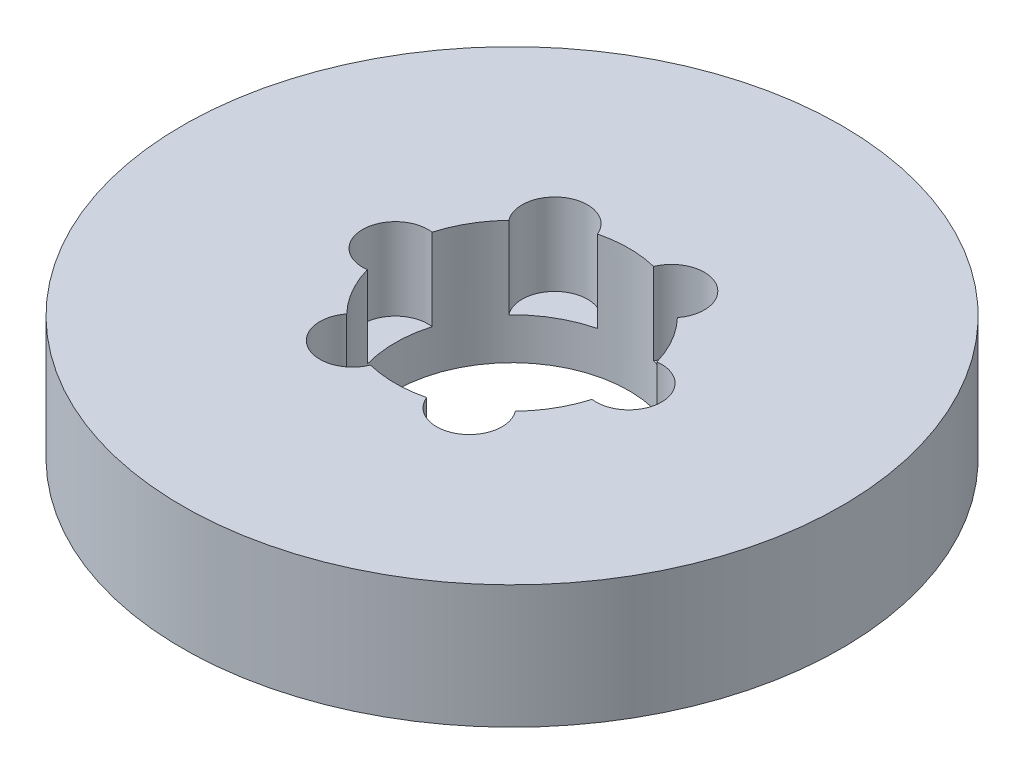
ISO-10303-21;
HEADER;
FILE_DESCRIPTION(('STEP AP214'),'2;1');
FILE_NAME('part.step','',(''),(''),'','','');
FILE_SCHEMA(('AUTOMOTIVE_DESIGN { 1 0 10303 214 1 1 1 1 }'));
ENDSEC;
DATA;
#1=APPLICATION_CONTEXT('core data for automotive mechanical design processes');
#2=APPLICATION_PROTOCOL_DEFINITION('international standard','automotive_design',2000,#1);
#3=PRODUCT_CONTEXT('',#1,'mechanical');
#4=PRODUCT('Part','Part','',(#3));
#5=PRODUCT_RELATED_PRODUCT_CATEGORY('part','',(#4));
#6=PRODUCT_DEFINITION_FORMATION('','',#4);
#7=PRODUCT_DEFINITION_CONTEXT('part definition',#1,'design');
#8=PRODUCT_DEFINITION('design','',#6,#7);
#9=PRODUCT_DEFINITION_SHAPE('','',#8);
#10=(LENGTH_UNIT() NAMED_UNIT(*) SI_UNIT(.MILLI.,.METRE.));
#11=(NAMED_UNIT(*) PLANE_ANGLE_UNIT() SI_UNIT($,.RADIAN.));
#12=(NAMED_UNIT(*) SI_UNIT($,.STERADIAN.) SOLID_ANGLE_UNIT());
#13=UNCERTAINTY_MEASURE_WITH_UNIT(LENGTH_MEASURE(1.E-05),#10,'distance_accuracy_value','');
#14=(GEOMETRIC_REPRESENTATION_CONTEXT(3) GLOBAL_UNCERTAINTY_ASSIGNED_CONTEXT((#13)) GLOBAL_UNIT_ASSIGNED_CONTEXT((#10,
#11,#12)) REPRESENTATION_CONTEXT('',''));
#15=CARTESIAN_POINT('',(0.,0.,0.));
#16=DIRECTION('',(0.,0.,1.));
#17=DIRECTION('',(1.,0.,0.));
#18=AXIS2_PLACEMENT_3D('',#15,#16,#17);
#19=CARTESIAN_POINT('',(0.,29.,0.));
#20=DIRECTION('',(0.,-1.,0.));
#21=DIRECTION('',(0.,0.,-1.));
#22=AXIS2_PLACEMENT_3D('',#19,#20,#21);
#23=CYLINDRICAL_SURFACE('',#22,77.5);
#24=CARTESIAN_POINT('',(0.,29.,0.));
#25=DIRECTION('',(0.,1.,0.));
#26=DIRECTION('',(0.,0.,1.));
#27=AXIS2_PLACEMENT_3D('',#24,#25,#26);
#28=CIRCLE('',#27,77.5);
#29=CARTESIAN_POINT('',(0.,29.,-77.5));
#30=VERTEX_POINT('',#29);
#31=EDGE_CURVE('E171',#30,#30,#28,.T.);
#32=CARTESIAN_POINT('',(0.,0.,0.));
#33=DIRECTION('',(0.,1.,0.));
#34=DIRECTION('',(0.,0.,1.));
#35=AXIS2_PLACEMENT_3D('',#32,#33,#34);
#36=CIRCLE('',#35,77.5);
#37=CARTESIAN_POINT('',(0.,0.,-77.5));
#38=VERTEX_POINT('',#37);
#39=EDGE_CURVE('E157',#38,#38,#36,.T.);
#40=CARTESIAN_POINT('',(0.,29.,-77.5));
#41=CARTESIAN_POINT('',(0.,28.6979166666667,-77.5));
#42=CARTESIAN_POINT('',(0.,28.3958333333333,-77.5));
#43=CARTESIAN_POINT('',(0.,27.7916666666667,-77.5));
#44=CARTESIAN_POINT('',(0.,27.4895833333333,-77.5));
#45=CARTESIAN_POINT('',(0.,26.8854166666667,-77.5));
#46=CARTESIAN_POINT('',(0.,26.5833333333333,-77.5));
#47=CARTESIAN_POINT('',(0.,25.9791666666667,-77.5));
#48=CARTESIAN_POINT('',(0.,25.6770833333333,-77.5));
#49=CARTESIAN_POINT('',(0.,25.0729166666667,-77.5));
#50=CARTESIAN_POINT('',(0.,24.7708333333333,-77.5));
#51=CARTESIAN_POINT('',(0.,24.1666666666667,-77.5));
#52=CARTESIAN_POINT('',(0.,23.8645833333333,-77.5));
#53=CARTESIAN_POINT('',(0.,23.2604166666667,-77.5));
#54=CARTESIAN_POINT('',(0.,22.9583333333333,-77.5));
#55=CARTESIAN_POINT('',(0.,22.3541666666667,-77.5));
#56=CARTESIAN_POINT('',(0.,22.0520833333333,-77.5));
#57=CARTESIAN_POINT('',(0.,21.4479166666667,-77.5));
#58=CARTESIAN_POINT('',(0.,21.1458333333333,-77.5));
#59=CARTESIAN_POINT('',(0.,20.5416666666667,-77.5));
#60=CARTESIAN_POINT('',(0.,20.2395833333333,-77.5));
#61=CARTESIAN_POINT('',(0.,19.6354166666667,-77.5));
#62=CARTESIAN_POINT('',(0.,19.3333333333333,-77.5));
#63=CARTESIAN_POINT('',(0.,18.7291666666667,-77.5));
#64=CARTESIAN_POINT('',(0.,18.4270833333333,-77.5));
#65=CARTESIAN_POINT('',(0.,17.8229166666667,-77.5));
#66=CARTESIAN_POINT('',(0.,17.5208333333333,-77.5));
#67=CARTESIAN_POINT('',(0.,16.9166666666667,-77.5));
#68=CARTESIAN_POINT('',(0.,16.6145833333333,-77.5));
#69=CARTESIAN_POINT('',(0.,16.0104166666667,-77.5));
#70=CARTESIAN_POINT('',(0.,15.7083333333333,-77.5));
#71=CARTESIAN_POINT('',(0.,15.1041666666667,-77.5));
#72=CARTESIAN_POINT('',(0.,14.8020833333333,-77.5));
#73=CARTESIAN_POINT('',(0.,14.1979166666667,-77.5));
#74=CARTESIAN_POINT('',(0.,13.8958333333333,-77.5));
#75=CARTESIAN_POINT('',(0.,13.2916666666667,-77.5));
#76=CARTESIAN_POINT('',(0.,12.9895833333333,-77.5));
#77=CARTESIAN_POINT('',(0.,12.3854166666667,-77.5));
#78=CARTESIAN_POINT('',(0.,12.0833333333333,-77.5));
#79=CARTESIAN_POINT('',(0.,11.4791666666667,-77.5));
#80=CARTESIAN_POINT('',(0.,11.1770833333333,-77.5));
#81=CARTESIAN_POINT('',(0.,10.5729166666667,-77.5));
#82=CARTESIAN_POINT('',(0.,10.2708333333333,-77.5));
#83=CARTESIAN_POINT('',(0.,9.66666666666667,-77.5));
#84=CARTESIAN_POINT('',(0.,9.36458333333333,-77.5));
#85=CARTESIAN_POINT('',(0.,8.76041666666667,-77.5));
#86=CARTESIAN_POINT('',(0.,8.45833333333333,-77.5));
#87=CARTESIAN_POINT('',(0.,7.85416666666667,-77.5));
#88=CARTESIAN_POINT('',(0.,7.55208333333333,-77.5));
#89=CARTESIAN_POINT('',(0.,6.94791666666667,-77.5));
#90=CARTESIAN_POINT('',(0.,6.64583333333333,-77.5));
#91=CARTESIAN_POINT('',(0.,6.04166666666667,-77.5));
#92=CARTESIAN_POINT('',(0.,5.73958333333333,-77.5));
#93=CARTESIAN_POINT('',(0.,5.13541666666667,-77.5));
#94=CARTESIAN_POINT('',(0.,4.83333333333333,-77.5));
#95=CARTESIAN_POINT('',(0.,4.22916666666667,-77.5));
#96=CARTESIAN_POINT('',(0.,3.92708333333333,-77.5));
#97=CARTESIAN_POINT('',(0.,3.32291666666667,-77.5));
#98=CARTESIAN_POINT('',(0.,3.02083333333333,-77.5));
#99=CARTESIAN_POINT('',(0.,2.41666666666667,-77.5));
#100=CARTESIAN_POINT('',(0.,2.11458333333333,-77.5));
#101=CARTESIAN_POINT('',(0.,1.51041666666667,-77.5));
#102=CARTESIAN_POINT('',(0.,1.20833333333333,-77.5));
#103=CARTESIAN_POINT('',(0.,0.604166666666667,-77.5));
#104=CARTESIAN_POINT('',(0.,0.302083333333333,-77.5));
#105=CARTESIAN_POINT('',(0.,0.,-77.5));
#106=B_SPLINE_CURVE_WITH_KNOTS('',3,(#40,#41,#42,#43,#44,#45,#46,#47,#48,#49,#50,#51,#52,#53,
#54,#55,#56,#57,#58,#59,#60,#61,#62,#63,#64,#65,#66,#67,#68,#69,#70,#71,#72,#73,#74,#75,#76,#77,
#78,#79,#80,#81,#82,#83,#84,#85,#86,#87,#88,#89,#90,#91,#92,#93,#94,#95,#96,#97,#98,#99,#100,
#101,#102,#103,#104,#105),.UNSPECIFIED.,.F.,.F.,(4,2,2,2,2,2,2,2,2,2,2,2,2,2,2,2,2,2,2,2,2,2,2,
2,2,2,2,2,2,2,2,2,4),(0.,0.906249999999997,1.8125,2.71875,3.625,4.53125,5.4375,6.34375,7.25,
8.15625,9.0625,9.96875,10.875,11.78125,12.6875,13.59375,14.5,15.40625,16.3125,17.21875,18.125,
19.03125,19.9375,20.84375,21.75,22.65625,23.5625,24.46875,25.375,26.28125,27.1875,28.09375,29.),.UNSPECIFIED.);
#107=EDGE_CURVE('BSEAM39',#30,#38,#106,.T.);
#108=ORIENTED_EDGE('',*,*,#31,.F.);
#109=ORIENTED_EDGE('',*,*,#39,.T.);
#110=ORIENTED_EDGE('',*,*,#107,.T.);
#111=ORIENTED_EDGE('',*,*,#107,.F.);
#112=EDGE_LOOP('',(#108,#110,#109,#111));
#113=FACE_BOUND('',#112,.T.);
#114=ADVANCED_FACE('F39',(#113),#23,.T.);
#115=CARTESIAN_POINT('',(0.,29.,0.));
#116=DIRECTION('',(0.,1.,0.));
#117=DIRECTION('',(0.,0.,1.));
#118=AXIS2_PLACEMENT_3D('',#115,#116,#117);
#119=PLANE('',#118);
#120=CARTESIAN_POINT('',(-13.7271433398994,29.,-23.7761097074858));
#121=DIRECTION('',(0.,1.,0.));
#122=DIRECTION('',(-0.866025403784433,0.,0.50000000000001));
#123=AXIS2_PLACEMENT_3D('',#120,#121,#122);
#124=CIRCLE('',#123,7.70044387345522);
#125=CARTESIAN_POINT('',(-6.60169345907737,29.,-26.695835695336));
#126=VERTEX_POINT('',#125);
#127=CARTESIAN_POINT('',(-19.8184251578781,29.,-19.0651520912261));
#128=VERTEX_POINT('',#127);
#129=EDGE_CURVE('E214',#126,#128,#124,.T.);
#130=ORIENTED_EDGE('',*,*,#129,.F.);
#131=CARTESIAN_POINT('',(0.,29.,0.));
#132=DIRECTION('',(0.,1.,0.));
#133=DIRECTION('',(0.,0.,1.));
#134=AXIS2_PLACEMENT_3D('',#131,#132,#133);
#135=CIRCLE('',#134,27.5);
#136=CARTESIAN_POINT('',(6.60169345907681,29.,-26.6958356953361));
#137=VERTEX_POINT('',#136);
#138=EDGE_CURVE('E272',#137,#126,#135,.T.);
#139=ORIENTED_EDGE('',*,*,#138,.F.);
#140=CARTESIAN_POINT('',(13.7271433398989,29.,-23.7761097074861));
#141=DIRECTION('',(0.,1.,0.));
#142=DIRECTION('',(-0.866025403784443,0.,-0.499999999999992));
#143=AXIS2_PLACEMENT_3D('',#140,#141,#142);
#144=CIRCLE('',#143,7.70044387345522);
#145=CARTESIAN_POINT('',(19.8184251578777,29.,-19.0651520912265));
#146=VERTEX_POINT('',#145);
#147=EDGE_CURVE('E285',#146,#137,#144,.T.);
#148=ORIENTED_EDGE('',*,*,#147,.F.);
#149=CARTESIAN_POINT('',(26.420118616955,29.,-7.63068360410973));
#150=VERTEX_POINT('',#149);
#151=EDGE_CURVE('E165',#150,#146,#135,.T.);
#152=ORIENTED_EDGE('',*,*,#151,.F.);
#153=CARTESIAN_POINT('',(27.4542866797982,29.,0.));
#154=DIRECTION('',(0.,1.,0.));
#155=DIRECTION('',(0.,0.,-1.));
#156=AXIS2_PLACEMENT_3D('',#153,#154,#155);
#157=CIRCLE('',#156,7.70044387345522);
#158=CARTESIAN_POINT('',(26.420118616955,29.,7.63068360410973));
#159=VERTEX_POINT('',#158);
#160=EDGE_CURVE('E281',#159,#150,#157,.T.);
#161=ORIENTED_EDGE('',*,*,#160,.F.);
#162=CARTESIAN_POINT('',(19.818425157878,29.,19.0651520912262));
#163=VERTEX_POINT('',#162);
#164=EDGE_CURVE('E160',#163,#159,#135,.T.);
#165=ORIENTED_EDGE('',*,*,#164,.F.);
#166=CARTESIAN_POINT('',(13.7271433398992,29.,23.7761097074859));
#167=DIRECTION('',(0.,1.,0.));
#168=DIRECTION('',(0.866025403784436,0.,-0.500000000000004));
#169=AXIS2_PLACEMENT_3D('',#166,#167,#168);
#170=CIRCLE('',#169,7.70044387345522);
#171=CARTESIAN_POINT('',(6.60169345907719,29.,26.695835695336));
#172=VERTEX_POINT('',#171);
#173=EDGE_CURVE('E154',#172,#163,#170,.T.);
#174=ORIENTED_EDGE('',*,*,#173,.F.);
#175=CARTESIAN_POINT('',(-6.601693459077,29.,26.6958356953361));
#176=VERTEX_POINT('',#175);
#177=EDGE_CURVE('E150',#176,#172,#135,.T.);
#178=ORIENTED_EDGE('',*,*,#177,.F.);
#179=CARTESIAN_POINT('',(-13.727143339899,29.,23.776109707486));
#180=DIRECTION('',(0.,1.,0.));
#181=DIRECTION('',(0.86602540378444,0.,0.499999999999998));
#182=AXIS2_PLACEMENT_3D('',#179,#180,#181);
#183=CIRCLE('',#182,7.70044387345522);
#184=CARTESIAN_POINT('',(-19.8184251578779,29.,19.0651520912264));
#185=VERTEX_POINT('',#184);
#186=EDGE_CURVE('E127',#185,#176,#183,.T.);
#187=ORIENTED_EDGE('',*,*,#186,.F.);
#188=CARTESIAN_POINT('',(-26.420118616955,29.,7.63068360410973));
#189=VERTEX_POINT('',#188);
#190=EDGE_CURVE('E156',#189,#185,#135,.T.);
#191=ORIENTED_EDGE('',*,*,#190,.F.);
#192=CARTESIAN_POINT('',(-27.4542866797982,29.,0.));
#193=DIRECTION('',(0.,1.,0.));
#194=DIRECTION('',(0.,0.,1.));
#195=AXIS2_PLACEMENT_3D('',#192,#193,#194);
#196=CIRCLE('',#195,7.70044387345522);
#197=CARTESIAN_POINT('',(-26.420118616955,29.,-7.63068360410973));
#198=VERTEX_POINT('',#197);
#199=EDGE_CURVE('E164',#198,#189,#196,.T.);
#200=ORIENTED_EDGE('',*,*,#199,.F.);
#201=EDGE_CURVE('E159',#128,#198,#135,.T.);
#202=ORIENTED_EDGE('',*,*,#201,.F.);
#203=EDGE_LOOP('',(#130,#139,#148,#152,#161,#165,#174,#178,#187,#191,#200,#202));
#204=FACE_BOUND('',#203,.T.);
#205=ORIENTED_EDGE('',*,*,#31,.T.);
#206=EDGE_LOOP('',(#205));
#207=FACE_BOUND('',#206,.T.);
#208=ADVANCED_FACE('F155',(#204,#207),#119,.T.);
#209=CARTESIAN_POINT('',(0.,0.,0.));
#210=DIRECTION('',(0.,1.,0.));
#211=DIRECTION('',(0.,0.,1.));
#212=AXIS2_PLACEMENT_3D('',#209,#210,#211);
#213=PLANE('',#212);
#214=CARTESIAN_POINT('',(0.,0.,0.));
#215=DIRECTION('',(0.,1.,0.));
#216=DIRECTION('',(0.,0.,1.));
#217=AXIS2_PLACEMENT_3D('',#214,#215,#216);
#218=CIRCLE('',#217,27.5);
#219=CARTESIAN_POINT('',(0.,0.,27.5));
#220=VERTEX_POINT('',#219);
#221=EDGE_CURVE('E170',#220,#220,#218,.T.);
#222=ORIENTED_EDGE('',*,*,#221,.T.);
#223=EDGE_LOOP('',(#222));
#224=FACE_BOUND('',#223,.T.);
#225=ORIENTED_EDGE('',*,*,#39,.F.);
#226=EDGE_LOOP('',(#225));
#227=FACE_BOUND('',#226,.T.);
#228=ADVANCED_FACE('F232',(#224,#227),#213,.F.);
#229=CARTESIAN_POINT('',(0.,29.,0.));
#230=DIRECTION('',(0.,-1.,0.));
#231=DIRECTION('',(0.,0.,-1.));
#232=AXIS2_PLACEMENT_3D('',#229,#230,#231);
#233=CYLINDRICAL_SURFACE('',#232,27.5);
#234=DIRECTION('',(0.,1.,0.));
#235=VECTOR('',#234,1.);
#236=CARTESIAN_POINT('',(-6.60169345907737,19.3809823346453,-26.695835695336));
#237=LINE('',#236,#235);
#238=CARTESIAN_POINT('',(-6.60169345907737,9.76196466929053,-26.695835695336));
#239=VERTEX_POINT('',#238);
#240=EDGE_CURVE('E11',#239,#126,#237,.T.);
#241=ORIENTED_EDGE('',*,*,#240,.F.);
#242=CARTESIAN_POINT('',(0.,9.76196466929053,0.));
#243=DIRECTION('',(0.,1.,0.));
#244=DIRECTION('',(0.,0.,1.));
#245=AXIS2_PLACEMENT_3D('',#242,#243,#244);
#246=CIRCLE('',#245,27.5);
#247=CARTESIAN_POINT('',(-19.8184251578781,9.76196466929053,-19.0651520912261));
#248=VERTEX_POINT('',#247);
#249=EDGE_CURVE('E209',#239,#248,#246,.T.);
#250=ORIENTED_EDGE('',*,*,#249,.T.);
#251=DIRECTION('',(0.,1.,0.));
#252=VECTOR('',#251,1.);
#253=CARTESIAN_POINT('',(-19.8184251578781,19.3809823346453,-19.0651520912261));
#254=LINE('',#253,#252);
#255=EDGE_CURVE('E46',#128,#248,#254,.F.);
#256=ORIENTED_EDGE('',*,*,#255,.F.);
#257=ORIENTED_EDGE('',*,*,#201,.T.);
#258=DIRECTION('',(0.,1.,0.));
#259=VECTOR('',#258,1.);
#260=CARTESIAN_POINT('',(-26.420118616955,19.3809823346453,-7.63068360410973));
#261=LINE('',#260,#259);
#262=CARTESIAN_POINT('',(-26.420118616955,9.76196466929053,-7.63068360410973));
#263=VERTEX_POINT('',#262);
#264=EDGE_CURVE('E185',#263,#198,#261,.T.);
#265=ORIENTED_EDGE('',*,*,#264,.F.);
#266=CARTESIAN_POINT('',(0.,9.76196466929053,0.));
#267=DIRECTION('',(0.,1.,0.));
#268=DIRECTION('',(0.,0.,1.));
#269=AXIS2_PLACEMENT_3D('',#266,#267,#268);
#270=CIRCLE('',#269,27.5);
#271=CARTESIAN_POINT('',(-26.420118616955,9.76196466929053,7.63068360410973));
#272=VERTEX_POINT('',#271);
#273=EDGE_CURVE('E173',#263,#272,#270,.T.);
#274=ORIENTED_EDGE('',*,*,#273,.T.);
#275=DIRECTION('',(0.,1.,0.));
#276=VECTOR('',#275,1.);
#277=CARTESIAN_POINT('',(-26.420118616955,19.3809823346453,7.63068360410973));
#278=LINE('',#277,#276);
#279=EDGE_CURVE('E178',#189,#272,#278,.F.);
#280=ORIENTED_EDGE('',*,*,#279,.F.);
#281=ORIENTED_EDGE('',*,*,#190,.T.);
#282=DIRECTION('',(0.,1.,0.));
#283=VECTOR('',#282,1.);
#284=CARTESIAN_POINT('',(-19.8184251578779,19.3809823346453,19.0651520912264));
#285=LINE('',#284,#283);
#286=CARTESIAN_POINT('',(-19.8184251578779,9.76196466929053,19.0651520912264));
#287=VERTEX_POINT('',#286);
#288=EDGE_CURVE('E132',#287,#185,#285,.T.);
#289=ORIENTED_EDGE('',*,*,#288,.F.);
#290=CARTESIAN_POINT('',(0.,9.76196466929053,0.));
#291=DIRECTION('',(0.,1.,0.));
#292=DIRECTION('',(0.,0.,1.));
#293=AXIS2_PLACEMENT_3D('',#290,#291,#292);
#294=CIRCLE('',#293,27.5);
#295=CARTESIAN_POINT('',(-6.601693459077,9.76196466929053,26.6958356953361));
#296=VERTEX_POINT('',#295);
#297=EDGE_CURVE('E146',#287,#296,#294,.T.);
#298=ORIENTED_EDGE('',*,*,#297,.T.);
#299=DIRECTION('',(0.,1.,0.));
#300=VECTOR('',#299,1.);
#301=CARTESIAN_POINT('',(-6.601693459077,19.3809823346453,26.6958356953361));
#302=LINE('',#301,#300);
#303=EDGE_CURVE('E128',#176,#296,#302,.F.);
#304=ORIENTED_EDGE('',*,*,#303,.F.);
#305=ORIENTED_EDGE('',*,*,#177,.T.);
#306=DIRECTION('',(0.,1.,0.));
#307=VECTOR('',#306,1.);
#308=CARTESIAN_POINT('',(6.60169345907719,19.3809823346453,26.695835695336));
#309=LINE('',#308,#307);
#310=CARTESIAN_POINT('',(6.60169345907719,9.76196466929053,26.695835695336));
#311=VERTEX_POINT('',#310);
#312=EDGE_CURVE('E192',#311,#172,#309,.T.);
#313=ORIENTED_EDGE('',*,*,#312,.F.);
#314=CARTESIAN_POINT('',(0.,9.76196466929053,0.));
#315=DIRECTION('',(0.,1.,0.));
#316=DIRECTION('',(0.,0.,1.));
#317=AXIS2_PLACEMENT_3D('',#314,#315,#316);
#318=CIRCLE('',#317,27.5);
#319=CARTESIAN_POINT('',(19.818425157878,9.76196466929053,19.0651520912262));
#320=VERTEX_POINT('',#319);
#321=EDGE_CURVE('E190',#311,#320,#318,.T.);
#322=ORIENTED_EDGE('',*,*,#321,.T.);
#323=DIRECTION('',(0.,1.,0.));
#324=VECTOR('',#323,1.);
#325=CARTESIAN_POINT('',(19.818425157878,19.3809823346453,19.0651520912262));
#326=LINE('',#325,#324);
#327=EDGE_CURVE('E189',#163,#320,#326,.F.);
#328=ORIENTED_EDGE('',*,*,#327,.F.);
#329=ORIENTED_EDGE('',*,*,#164,.T.);
#330=DIRECTION('',(0.,1.,0.));
#331=VECTOR('',#330,1.);
#332=CARTESIAN_POINT('',(26.420118616955,19.3809823346453,7.63068360410973));
#333=LINE('',#332,#331);
#334=CARTESIAN_POINT('',(26.420118616955,9.76196466929053,7.63068360410973));
#335=VERTEX_POINT('',#334);
#336=EDGE_CURVE('E203',#335,#159,#333,.T.);
#337=ORIENTED_EDGE('',*,*,#336,.F.);
#338=CARTESIAN_POINT('',(0.,9.76196466929053,0.));
#339=DIRECTION('',(0.,1.,0.));
#340=DIRECTION('',(0.,0.,1.));
#341=AXIS2_PLACEMENT_3D('',#338,#339,#340);
#342=CIRCLE('',#341,27.5);
#343=CARTESIAN_POINT('',(26.420118616955,9.76196466929053,-7.63068360410973));
#344=VERTEX_POINT('',#343);
#345=EDGE_CURVE('E194',#335,#344,#342,.T.);
#346=ORIENTED_EDGE('',*,*,#345,.T.);
#347=DIRECTION('',(0.,1.,0.));
#348=VECTOR('',#347,1.);
#349=CARTESIAN_POINT('',(26.420118616955,19.3809823346453,-7.63068360410973));
#350=LINE('',#349,#348);
#351=EDGE_CURVE('E196',#150,#344,#350,.F.);
#352=ORIENTED_EDGE('',*,*,#351,.F.);
#353=ORIENTED_EDGE('',*,*,#151,.T.);
#354=DIRECTION('',(0.,1.,0.));
#355=VECTOR('',#354,1.);
#356=CARTESIAN_POINT('',(19.8184251578777,19.3809823346453,-19.0651520912265));
#357=LINE('',#356,#355);
#358=CARTESIAN_POINT('',(19.8184251578777,9.76196466929053,-19.0651520912265));
#359=VERTEX_POINT('',#358);
#360=EDGE_CURVE('E208',#359,#146,#357,.T.);
#361=ORIENTED_EDGE('',*,*,#360,.F.);
#362=CARTESIAN_POINT('',(0.,9.76196466929053,0.));
#363=DIRECTION('',(0.,1.,0.));
#364=DIRECTION('',(0.,0.,1.));
#365=AXIS2_PLACEMENT_3D('',#362,#363,#364);
#366=CIRCLE('',#365,27.5);
#367=CARTESIAN_POINT('',(6.60169345907681,9.76196466929053,-26.6958356953361));
#368=VERTEX_POINT('',#367);
#369=EDGE_CURVE('E201',#359,#368,#366,.T.);
#370=ORIENTED_EDGE('',*,*,#369,.T.);
#371=DIRECTION('',(0.,1.,0.));
#372=VECTOR('',#371,1.);
#373=CARTESIAN_POINT('',(6.60169345907681,19.3809823346453,-26.6958356953361));
#374=LINE('',#373,#372);
#375=EDGE_CURVE('E206',#137,#368,#374,.F.);
#376=ORIENTED_EDGE('',*,*,#375,.F.);
#377=ORIENTED_EDGE('',*,*,#138,.T.);
#378=EDGE_LOOP('',(#241,#250,#256,#257,#265,#274,#280,#281,#289,#298,#304,#305,#313,#322,#328,
#329,#337,#346,#352,#353,#361,#370,#376,#377));
#379=FACE_BOUND('',#378,.T.);
#380=ORIENTED_EDGE('',*,*,#221,.F.);
#381=EDGE_LOOP('',(#380));
#382=FACE_BOUND('',#381,.T.);
#383=ADVANCED_FACE('F145',(#379,#382),#233,.F.);
#384=CARTESIAN_POINT('',(-27.4542866797982,9.76196466929053,0.));
#385=DIRECTION('',(0.,1.,0.));
#386=DIRECTION('',(0.,0.,1.));
#387=AXIS2_PLACEMENT_3D('',#384,#385,#386);
#388=CYLINDRICAL_SURFACE('',#387,7.70044387345522);
#389=ORIENTED_EDGE('',*,*,#264,.T.);
#390=ORIENTED_EDGE('',*,*,#199,.T.);
#391=ORIENTED_EDGE('',*,*,#279,.T.);
#392=CARTESIAN_POINT('',(-27.4542866797982,9.76196466929053,0.));
#393=DIRECTION('',(0.,1.,0.));
#394=DIRECTION('',(0.,0.,1.));
#395=AXIS2_PLACEMENT_3D('',#392,#393,#394);
#396=CIRCLE('',#395,7.70044387345522);
#397=EDGE_CURVE('E168',#263,#272,#396,.T.);
#398=ORIENTED_EDGE('',*,*,#397,.F.);
#399=EDGE_LOOP('',(#389,#390,#391,#398));
#400=FACE_BOUND('',#399,.T.);
#401=ADVANCED_FACE('F243',(#400),#388,.F.);
#402=CARTESIAN_POINT('',(-27.4542866797982,9.76196466929053,0.));
#403=DIRECTION('',(0.,1.,0.));
#404=DIRECTION('',(0.,0.,1.));
#405=AXIS2_PLACEMENT_3D('',#402,#403,#404);
#406=PLANE('',#405);
#407=ORIENTED_EDGE('',*,*,#397,.T.);
#408=ORIENTED_EDGE('',*,*,#273,.F.);
#409=EDGE_LOOP('',(#407,#408));
#410=FACE_BOUND('',#409,.T.);
#411=ADVANCED_FACE('F247',(#410),#406,.T.);
#412=CARTESIAN_POINT('',(-13.727143339899,9.76196466929053,23.776109707486));
#413=DIRECTION('',(0.,1.,0.));
#414=DIRECTION('',(0.,0.,1.));
#415=AXIS2_PLACEMENT_3D('',#412,#413,#414);
#416=CYLINDRICAL_SURFACE('',#415,7.70044387345522);
#417=ORIENTED_EDGE('',*,*,#288,.T.);
#418=ORIENTED_EDGE('',*,*,#186,.T.);
#419=ORIENTED_EDGE('',*,*,#303,.T.);
#420=CARTESIAN_POINT('',(-13.727143339899,9.76196466929053,23.776109707486));
#421=DIRECTION('',(0.,1.,0.));
#422=DIRECTION('',(0.86602540378444,0.,0.499999999999998));
#423=AXIS2_PLACEMENT_3D('',#420,#421,#422);
#424=CIRCLE('',#423,7.70044387345522);
#425=EDGE_CURVE('E137',#287,#296,#424,.T.);
#426=ORIENTED_EDGE('',*,*,#425,.F.);
#427=EDGE_LOOP('',(#417,#418,#419,#426));
#428=FACE_BOUND('',#427,.T.);
#429=ADVANCED_FACE('F126',(#428),#416,.F.);
#430=CARTESIAN_POINT('',(-13.727143339899,9.76196466929053,23.776109707486));
#431=DIRECTION('',(0.,1.,0.));
#432=DIRECTION('',(0.86602540378444,0.,0.499999999999998));
#433=AXIS2_PLACEMENT_3D('',#430,#431,#432);
#434=PLANE('',#433);
#435=ORIENTED_EDGE('',*,*,#425,.T.);
#436=ORIENTED_EDGE('',*,*,#297,.F.);
#437=EDGE_LOOP('',(#435,#436));
#438=FACE_BOUND('',#437,.T.);
#439=ADVANCED_FACE('F254',(#438),#434,.T.);
#440=CARTESIAN_POINT('',(13.7271433398992,9.76196466929053,23.7761097074859));
#441=DIRECTION('',(0.,1.,0.));
#442=DIRECTION('',(0.,0.,1.));
#443=AXIS2_PLACEMENT_3D('',#440,#441,#442);
#444=CYLINDRICAL_SURFACE('',#443,7.70044387345522);
#445=ORIENTED_EDGE('',*,*,#312,.T.);
#446=ORIENTED_EDGE('',*,*,#173,.T.);
#447=ORIENTED_EDGE('',*,*,#327,.T.);
#448=CARTESIAN_POINT('',(13.7271433398992,9.76196466929053,23.7761097074859));
#449=DIRECTION('',(0.,1.,0.));
#450=DIRECTION('',(0.866025403784436,0.,-0.500000000000004));
#451=AXIS2_PLACEMENT_3D('',#448,#449,#450);
#452=CIRCLE('',#451,7.70044387345522);
#453=EDGE_CURVE('E138',#311,#320,#452,.T.);
#454=ORIENTED_EDGE('',*,*,#453,.F.);
#455=EDGE_LOOP('',(#445,#446,#447,#454));
#456=FACE_BOUND('',#455,.T.);
#457=ADVANCED_FACE('F260',(#456),#444,.F.);
#458=CARTESIAN_POINT('',(13.7271433398992,9.76196466929053,23.7761097074859));
#459=DIRECTION('',(0.,1.,0.));
#460=DIRECTION('',(0.866025403784436,0.,-0.500000000000004));
#461=AXIS2_PLACEMENT_3D('',#458,#459,#460);
#462=PLANE('',#461);
#463=ORIENTED_EDGE('',*,*,#453,.T.);
#464=ORIENTED_EDGE('',*,*,#321,.F.);
#465=EDGE_LOOP('',(#463,#464));
#466=FACE_BOUND('',#465,.T.);
#467=ADVANCED_FACE('F265',(#466),#462,.T.);
#468=CARTESIAN_POINT('',(27.4542866797982,9.76196466929053,0.));
#469=DIRECTION('',(0.,1.,0.));
#470=DIRECTION('',(0.,0.,1.));
#471=AXIS2_PLACEMENT_3D('',#468,#469,#470);
#472=CYLINDRICAL_SURFACE('',#471,7.70044387345522);
#473=ORIENTED_EDGE('',*,*,#336,.T.);
#474=ORIENTED_EDGE('',*,*,#160,.T.);
#475=ORIENTED_EDGE('',*,*,#351,.T.);
#476=CARTESIAN_POINT('',(27.4542866797982,9.76196466929053,0.));
#477=DIRECTION('',(0.,1.,0.));
#478=DIRECTION('',(0.,0.,-1.));
#479=AXIS2_PLACEMENT_3D('',#476,#477,#478);
#480=CIRCLE('',#479,7.70044387345522);
#481=EDGE_CURVE('E287',#335,#344,#480,.T.);
#482=ORIENTED_EDGE('',*,*,#481,.F.);
#483=EDGE_LOOP('',(#473,#474,#475,#482));
#484=FACE_BOUND('',#483,.T.);
#485=ADVANCED_FACE('F300',(#484),#472,.F.);
#486=CARTESIAN_POINT('',(27.4542866797982,9.76196466929053,0.));
#487=DIRECTION('',(0.,1.,0.));
#488=DIRECTION('',(0.,0.,-1.));
#489=AXIS2_PLACEMENT_3D('',#486,#487,#488);
#490=PLANE('',#489);
#491=ORIENTED_EDGE('',*,*,#481,.T.);
#492=ORIENTED_EDGE('',*,*,#345,.F.);
#493=EDGE_LOOP('',(#491,#492));
#494=FACE_BOUND('',#493,.T.);
#495=ADVANCED_FACE('F298',(#494),#490,.T.);
#496=CARTESIAN_POINT('',(13.7271433398989,9.76196466929053,-23.7761097074861));
#497=DIRECTION('',(0.,1.,0.));
#498=DIRECTION('',(0.,0.,1.));
#499=AXIS2_PLACEMENT_3D('',#496,#497,#498);
#500=CYLINDRICAL_SURFACE('',#499,7.70044387345522);
#501=ORIENTED_EDGE('',*,*,#360,.T.);
#502=ORIENTED_EDGE('',*,*,#147,.T.);
#503=ORIENTED_EDGE('',*,*,#375,.T.);
#504=CARTESIAN_POINT('',(13.7271433398989,9.76196466929053,-23.7761097074861));
#505=DIRECTION('',(0.,1.,0.));
#506=DIRECTION('',(-0.866025403784443,0.,-0.499999999999992));
#507=AXIS2_PLACEMENT_3D('',#504,#505,#506);
#508=CIRCLE('',#507,7.70044387345522);
#509=EDGE_CURVE('E56',#359,#368,#508,.T.);
#510=ORIENTED_EDGE('',*,*,#509,.F.);
#511=EDGE_LOOP('',(#501,#502,#503,#510));
#512=FACE_BOUND('',#511,.T.);
#513=ADVANCED_FACE('F301',(#512),#500,.F.);
#514=CARTESIAN_POINT('',(13.7271433398989,9.76196466929053,-23.7761097074861));
#515=DIRECTION('',(0.,1.,0.));
#516=DIRECTION('',(-0.866025403784443,0.,-0.499999999999992));
#517=AXIS2_PLACEMENT_3D('',#514,#515,#516);
#518=PLANE('',#517);
#519=ORIENTED_EDGE('',*,*,#509,.T.);
#520=ORIENTED_EDGE('',*,*,#369,.F.);
#521=EDGE_LOOP('',(#519,#520));
#522=FACE_BOUND('',#521,.T.);
#523=ADVANCED_FACE('F221',(#522),#518,.T.);
#524=CARTESIAN_POINT('',(-13.7271433398994,9.76196466929053,-23.7761097074858));
#525=DIRECTION('',(0.,1.,0.));
#526=DIRECTION('',(0.,0.,1.));
#527=AXIS2_PLACEMENT_3D('',#524,#525,#526);
#528=CYLINDRICAL_SURFACE('',#527,7.70044387345522);
#529=ORIENTED_EDGE('',*,*,#240,.T.);
#530=ORIENTED_EDGE('',*,*,#129,.T.);
#531=ORIENTED_EDGE('',*,*,#255,.T.);
#532=CARTESIAN_POINT('',(-13.7271433398994,9.76196466929053,-23.7761097074858));
#533=DIRECTION('',(0.,1.,0.));
#534=DIRECTION('',(-0.866025403784433,0.,0.50000000000001));
#535=AXIS2_PLACEMENT_3D('',#532,#533,#534);
#536=CIRCLE('',#535,7.70044387345522);
#537=EDGE_CURVE('E55',#239,#248,#536,.T.);
#538=ORIENTED_EDGE('',*,*,#537,.F.);
#539=EDGE_LOOP('',(#529,#530,#531,#538));
#540=FACE_BOUND('',#539,.T.);
#541=ADVANCED_FACE('F212',(#540),#528,.F.);
#542=CARTESIAN_POINT('',(-13.7271433398994,9.76196466929053,-23.7761097074858));
#543=DIRECTION('',(0.,1.,0.));
#544=DIRECTION('',(-0.866025403784433,0.,0.50000000000001));
#545=AXIS2_PLACEMENT_3D('',#542,#543,#544);
#546=PLANE('',#545);
#547=ORIENTED_EDGE('',*,*,#537,.T.);
#548=ORIENTED_EDGE('',*,*,#249,.F.);
#549=EDGE_LOOP('',(#547,#548));
#550=FACE_BOUND('',#549,.T.);
#551=ADVANCED_FACE('F217',(#550),#546,.T.);
#552=CLOSED_SHELL('',(#114,#208,#228,#383,#401,#411,#429,#439,#457,#467,#485,#495,#513,#523,
#541,#551));
#553=MANIFOLD_SOLID_BREP('B2',#552);
#554=ADVANCED_BREP_SHAPE_REPRESENTATION('',(#18,#553),#14);
#555=SHAPE_DEFINITION_REPRESENTATION(#9,#554);
ENDSEC;
END-ISO-10303-21;
